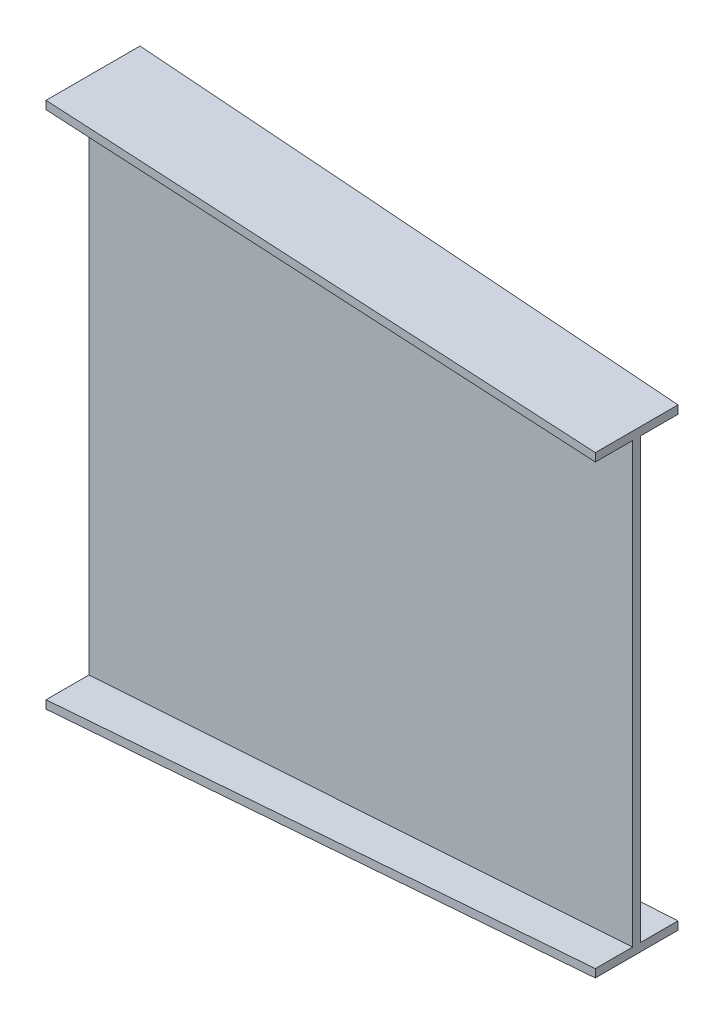
ISO-10303-21;
HEADER;
FILE_DESCRIPTION(('STEP AP214'),'2;1');
FILE_NAME('part.step','',(''),(''),'','','');
FILE_SCHEMA(('AUTOMOTIVE_DESIGN { 1 0 10303 214 1 1 1 1 }'));
ENDSEC;
DATA;
#1=APPLICATION_CONTEXT('core data for automotive mechanical design processes');
#2=APPLICATION_PROTOCOL_DEFINITION('international standard','automotive_design',2000,#1);
#3=PRODUCT_CONTEXT('',#1,'mechanical');
#4=PRODUCT('Part','Part','',(#3));
#5=PRODUCT_RELATED_PRODUCT_CATEGORY('part','',(#4));
#6=PRODUCT_DEFINITION_FORMATION('','',#4);
#7=PRODUCT_DEFINITION_CONTEXT('part definition',#1,'design');
#8=PRODUCT_DEFINITION('design','',#6,#7);
#9=PRODUCT_DEFINITION_SHAPE('','',#8);
#10=(LENGTH_UNIT() NAMED_UNIT(*) SI_UNIT(.MILLI.,.METRE.));
#11=(NAMED_UNIT(*) PLANE_ANGLE_UNIT() SI_UNIT($,.RADIAN.));
#12=(NAMED_UNIT(*) SI_UNIT($,.STERADIAN.) SOLID_ANGLE_UNIT());
#13=UNCERTAINTY_MEASURE_WITH_UNIT(LENGTH_MEASURE(1.E-05),#10,'distance_accuracy_value','');
#14=(GEOMETRIC_REPRESENTATION_CONTEXT(3) GLOBAL_UNCERTAINTY_ASSIGNED_CONTEXT((#13)) GLOBAL_UNIT_ASSIGNED_CONTEXT((#10,
#11,#12)) REPRESENTATION_CONTEXT('',''));
#15=CARTESIAN_POINT('',(0.,0.,0.));
#16=DIRECTION('',(0.,0.,1.));
#17=DIRECTION('',(1.,0.,0.));
#18=AXIS2_PLACEMENT_3D('',#15,#16,#17);
#19=CARTESIAN_POINT('',(1000.,0.,0.));
#20=DIRECTION('',(-1.,0.,0.));
#21=DIRECTION('',(0.,0.,1.));
#22=AXIS2_PLACEMENT_3D('',#19,#20,#21);
#23=PLANE('',#22);
#24=DIRECTION('',(0.,-1.,0.));
#25=VECTOR('',#24,1.);
#26=CARTESIAN_POINT('',(1000.,418.5,-68.4999999999994));
#27=LINE('',#26,#25);
#28=CARTESIAN_POINT('',(1000.,418.5,-68.4999999999994));
#29=VERTEX_POINT('',#28);
#30=CARTESIAN_POINT('',(1000.,403.5,-68.4999999999994));
#31=VERTEX_POINT('',#30);
#32=EDGE_CURVE('E375',#29,#31,#27,.T.);
#33=ORIENTED_EDGE('',*,*,#32,.F.);
#34=DIRECTION('',(0.,0.,-1.));
#35=VECTOR('',#34,1.);
#36=CARTESIAN_POINT('',(1000.,418.5,-68.4999999999994));
#37=LINE('',#36,#35);
#38=CARTESIAN_POINT('',(1000.,418.5,83.5000000000006));
#39=VERTEX_POINT('',#38);
#40=EDGE_CURVE('E12',#39,#29,#37,.T.);
#41=ORIENTED_EDGE('',*,*,#40,.F.);
#42=DIRECTION('',(0.,1.,0.));
#43=VECTOR('',#42,1.);
#44=CARTESIAN_POINT('',(1000.,418.5,83.5000000000006));
#45=LINE('',#44,#43);
#46=CARTESIAN_POINT('',(1000.,403.5,83.5000000000006));
#47=VERTEX_POINT('',#46);
#48=EDGE_CURVE('E69',#47,#39,#45,.T.);
#49=ORIENTED_EDGE('',*,*,#48,.F.);
#50=DIRECTION('',(0.,0.,1.));
#51=VECTOR('',#50,1.);
#52=CARTESIAN_POINT('',(1000.,403.5,15.0000000000006));
#53=LINE('',#52,#51);
#54=CARTESIAN_POINT('',(1000.,403.5,15.0000000000006));
#55=VERTEX_POINT('',#54);
#56=EDGE_CURVE('E650',#55,#47,#53,.T.);
#57=ORIENTED_EDGE('',*,*,#56,.F.);
#58=DIRECTION('',(0.,1.,0.));
#59=VECTOR('',#58,1.);
#60=CARTESIAN_POINT('',(1000.,403.5,15.0000000000006));
#61=LINE('',#60,#59);
#62=CARTESIAN_POINT('',(1000.,-403.5,15.0000000000003));
#63=VERTEX_POINT('',#62);
#64=EDGE_CURVE('E412',#63,#55,#61,.T.);
#65=ORIENTED_EDGE('',*,*,#64,.F.);
#66=DIRECTION('',(0.,0.,-1.));
#67=VECTOR('',#66,1.);
#68=CARTESIAN_POINT('',(1000.,-403.5,15.0000000000003));
#69=LINE('',#68,#67);
#70=CARTESIAN_POINT('',(1000.,-403.5,83.5000000000006));
#71=VERTEX_POINT('',#70);
#72=EDGE_CURVE('E426',#71,#63,#69,.T.);
#73=ORIENTED_EDGE('',*,*,#72,.F.);
#74=DIRECTION('',(0.,1.,0.));
#75=VECTOR('',#74,1.);
#76=CARTESIAN_POINT('',(1000.,-403.5,83.5000000000006));
#77=LINE('',#76,#75);
#78=CARTESIAN_POINT('',(1000.,-418.5,83.5000000000006));
#79=VERTEX_POINT('',#78);
#80=EDGE_CURVE('E440',#79,#71,#77,.T.);
#81=ORIENTED_EDGE('',*,*,#80,.F.);
#82=DIRECTION('',(0.,0.,1.));
#83=VECTOR('',#82,1.);
#84=CARTESIAN_POINT('',(1000.,-418.5,-68.4999999999994));
#85=LINE('',#84,#83);
#86=CARTESIAN_POINT('',(1000.,-418.5,-68.4999999999994));
#87=VERTEX_POINT('',#86);
#88=EDGE_CURVE('E621',#87,#79,#85,.T.);
#89=ORIENTED_EDGE('',*,*,#88,.F.);
#90=DIRECTION('',(0.,-1.,0.));
#91=VECTOR('',#90,1.);
#92=CARTESIAN_POINT('',(1000.,-403.5,-68.4999999999994));
#93=LINE('',#92,#91);
#94=CARTESIAN_POINT('',(1000.,-403.5,-68.4999999999994));
#95=VERTEX_POINT('',#94);
#96=EDGE_CURVE('E613',#95,#87,#93,.T.);
#97=ORIENTED_EDGE('',*,*,#96,.F.);
#98=DIRECTION('',(0.,0.,-1.));
#99=VECTOR('',#98,1.);
#100=CARTESIAN_POINT('',(1000.,-403.5,-68.4999999999994));
#101=LINE('',#100,#99);
#102=CARTESIAN_POINT('',(1000.,-403.5,6.66133814775094E-13));
#103=VERTEX_POINT('',#102);
#104=EDGE_CURVE('E528',#103,#95,#101,.T.);
#105=ORIENTED_EDGE('',*,*,#104,.F.);
#106=DIRECTION('',(0.,-1.,0.));
#107=VECTOR('',#106,1.);
#108=CARTESIAN_POINT('',(1000.,403.5,6.66133814775094E-13));
#109=LINE('',#108,#107);
#110=CARTESIAN_POINT('',(1000.,403.5,6.66133814775094E-13));
#111=VERTEX_POINT('',#110);
#112=EDGE_CURVE('E83',#111,#103,#109,.T.);
#113=ORIENTED_EDGE('',*,*,#112,.F.);
#114=DIRECTION('',(0.,0.,1.));
#115=VECTOR('',#114,1.);
#116=CARTESIAN_POINT('',(1000.,403.5,-68.4999999999994));
#117=LINE('',#116,#115);
#118=EDGE_CURVE('E77',#31,#111,#117,.T.);
#119=ORIENTED_EDGE('',*,*,#118,.F.);
#120=EDGE_LOOP('',(#33,#41,#49,#57,#65,#73,#81,#89,#97,#105,#113,#119));
#121=FACE_BOUND('',#120,.T.);
#122=ADVANCED_FACE('F59',(#121),#23,.F.);
#123=CARTESIAN_POINT('',(0.,0.,0.));
#124=DIRECTION('',(1.,0.,0.));
#125=DIRECTION('',(0.,0.,-1.));
#126=AXIS2_PLACEMENT_3D('',#123,#124,#125);
#127=PLANE('',#126);
#128=DIRECTION('',(0.,-1.,0.));
#129=VECTOR('',#128,1.);
#130=CARTESIAN_POINT('',(0.,485.,94.0000000000004));
#131=LINE('',#130,#129);
#132=CARTESIAN_POINT('',(0.,485.,94.0000000000004));
#133=VERTEX_POINT('',#132);
#134=CARTESIAN_POINT('',(0.,470.,94.0000000000004));
#135=VERTEX_POINT('',#134);
#136=EDGE_CURVE('E158',#133,#135,#131,.T.);
#137=ORIENTED_EDGE('',*,*,#136,.F.);
#138=DIRECTION('',(0.,0.,1.));
#139=VECTOR('',#138,1.);
#140=CARTESIAN_POINT('',(0.,485.,94.0000000000004));
#141=LINE('',#140,#139);
#142=CARTESIAN_POINT('',(0.,485.,-78.9999999999995));
#143=VERTEX_POINT('',#142);
#144=EDGE_CURVE('E167',#143,#133,#141,.T.);
#145=ORIENTED_EDGE('',*,*,#144,.F.);
#146=DIRECTION('',(0.,1.,0.));
#147=VECTOR('',#146,1.);
#148=CARTESIAN_POINT('',(0.,485.,-78.9999999999995));
#149=LINE('',#148,#147);
#150=CARTESIAN_POINT('',(0.,470.,-78.9999999999995));
#151=VERTEX_POINT('',#150);
#152=EDGE_CURVE('E174',#151,#143,#149,.T.);
#153=ORIENTED_EDGE('',*,*,#152,.F.);
#154=DIRECTION('',(0.,0.,-1.));
#155=VECTOR('',#154,1.);
#156=CARTESIAN_POINT('',(0.,470.,4.48288267103926E-13));
#157=LINE('',#156,#155);
#158=CARTESIAN_POINT('',(0.,470.,4.48288267103926E-13));
#159=VERTEX_POINT('',#158);
#160=EDGE_CURVE('E298',#159,#151,#157,.T.);
#161=ORIENTED_EDGE('',*,*,#160,.F.);
#162=DIRECTION('',(0.,1.,0.));
#163=VECTOR('',#162,1.);
#164=CARTESIAN_POINT('',(0.,470.,4.48288267103926E-13));
#165=LINE('',#164,#163);
#166=CARTESIAN_POINT('',(0.,-470.,4.48288267103926E-13));
#167=VERTEX_POINT('',#166);
#168=EDGE_CURVE('E294',#167,#159,#165,.T.);
#169=ORIENTED_EDGE('',*,*,#168,.F.);
#170=DIRECTION('',(0.,0.,1.));
#171=VECTOR('',#170,1.);
#172=CARTESIAN_POINT('',(0.,-470.,4.48288267103926E-13));
#173=LINE('',#172,#171);
#174=CARTESIAN_POINT('',(0.,-470.,-78.9999999999998));
#175=VERTEX_POINT('',#174);
#176=EDGE_CURVE('E290',#175,#167,#173,.T.);
#177=ORIENTED_EDGE('',*,*,#176,.F.);
#178=DIRECTION('',(0.,1.,0.));
#179=VECTOR('',#178,1.);
#180=CARTESIAN_POINT('',(0.,-470.,-78.9999999999998));
#181=LINE('',#180,#179);
#182=CARTESIAN_POINT('',(0.,-485.,-78.9999999999998));
#183=VERTEX_POINT('',#182);
#184=EDGE_CURVE('E286',#183,#175,#181,.T.);
#185=ORIENTED_EDGE('',*,*,#184,.F.);
#186=DIRECTION('',(0.,0.,-1.));
#187=VECTOR('',#186,1.);
#188=CARTESIAN_POINT('',(0.,-485.,94.0000000000001));
#189=LINE('',#188,#187);
#190=CARTESIAN_POINT('',(0.,-485.,94.0000000000001));
#191=VERTEX_POINT('',#190);
#192=EDGE_CURVE('E282',#191,#183,#189,.T.);
#193=ORIENTED_EDGE('',*,*,#192,.F.);
#194=DIRECTION('',(0.,-1.,0.));
#195=VECTOR('',#194,1.);
#196=CARTESIAN_POINT('',(0.,-470.,94.0000000000002));
#197=LINE('',#196,#195);
#198=CARTESIAN_POINT('',(0.,-470.,94.0000000000002));
#199=VERTEX_POINT('',#198);
#200=EDGE_CURVE('E278',#199,#191,#197,.T.);
#201=ORIENTED_EDGE('',*,*,#200,.F.);
#202=DIRECTION('',(0.,0.,1.));
#203=VECTOR('',#202,1.);
#204=CARTESIAN_POINT('',(0.,-470.,94.0000000000002));
#205=LINE('',#204,#203);
#206=CARTESIAN_POINT('',(0.,-470.,15.0000000000005));
#207=VERTEX_POINT('',#206);
#208=EDGE_CURVE('E273',#207,#199,#205,.T.);
#209=ORIENTED_EDGE('',*,*,#208,.F.);
#210=DIRECTION('',(0.,-1.,0.));
#211=VECTOR('',#210,1.);
#212=CARTESIAN_POINT('',(0.,470.,15.0000000000005));
#213=LINE('',#212,#211);
#214=CARTESIAN_POINT('',(0.,470.,15.0000000000005));
#215=VERTEX_POINT('',#214);
#216=EDGE_CURVE('E271',#215,#207,#213,.T.);
#217=ORIENTED_EDGE('',*,*,#216,.F.);
#218=DIRECTION('',(0.,0.,-1.));
#219=VECTOR('',#218,1.);
#220=CARTESIAN_POINT('',(0.,470.,94.0000000000004));
#221=LINE('',#220,#219);
#222=EDGE_CURVE('E180',#135,#215,#221,.T.);
#223=ORIENTED_EDGE('',*,*,#222,.F.);
#224=EDGE_LOOP('',(#137,#145,#153,#161,#169,#177,#185,#193,#201,#209,#217,#223));
#225=FACE_BOUND('',#224,.T.);
#226=ADVANCED_FACE('F178',(#225),#127,.F.);
#227=CARTESIAN_POINT('',(0.,0.,15.0000000000006));
#228=DIRECTION('',(0.,0.,1.));
#229=DIRECTION('',(0.,-1.,0.));
#230=AXIS2_PLACEMENT_3D('',#227,#228,#229);
#231=PLANE('',#230);
#232=DIRECTION('',(0.997796181688927,0.0663534460823136,0.));
#233=VECTOR('',#232,1.);
#234=CARTESIAN_POINT('',(0.,-470.,15.0000000000005));
#235=LINE('',#234,#233);
#236=EDGE_CURVE('E173',#207,#63,#235,.T.);
#237=ORIENTED_EDGE('',*,*,#236,.T.);
#238=ORIENTED_EDGE('',*,*,#64,.T.);
#239=DIRECTION('',(0.997796181688927,-0.0663534460823136,0.));
#240=VECTOR('',#239,1.);
#241=CARTESIAN_POINT('',(0.,470.,15.0000000000005));
#242=LINE('',#241,#240);
#243=EDGE_CURVE('E385',#215,#55,#242,.T.);
#244=ORIENTED_EDGE('',*,*,#243,.F.);
#245=ORIENTED_EDGE('',*,*,#216,.T.);
#246=EDGE_LOOP('',(#237,#238,#244,#245));
#247=FACE_BOUND('',#246,.T.);
#248=ADVANCED_FACE('F201',(#247),#231,.T.);
#249=CARTESIAN_POINT('',(31.1173911171323,467.930693490711,0.));
#250=DIRECTION('',(-0.0663534460823136,-0.997796181688927,0.));
#251=DIRECTION('',(0.997796181688927,-0.0663534460823136,0.));
#252=AXIS2_PLACEMENT_3D('',#249,#250,#251);
#253=PLANE('',#252);
#254=ORIENTED_EDGE('',*,*,#243,.T.);
#255=ORIENTED_EDGE('',*,*,#56,.T.);
#256=DIRECTION('',(0.997741424850504,-0.0663498047525585,-0.0104762849609302));
#257=VECTOR('',#256,1.);
#258=CARTESIAN_POINT('',(0.,470.,94.0000000000004));
#259=LINE('',#258,#257);
#260=EDGE_CURVE('E163',#135,#47,#259,.T.);
#261=ORIENTED_EDGE('',*,*,#260,.F.);
#262=ORIENTED_EDGE('',*,*,#222,.T.);
#263=EDGE_LOOP('',(#254,#255,#261,#262));
#264=FACE_BOUND('',#263,.T.);
#265=ADVANCED_FACE('F387',(#264),#253,.T.);
#266=CARTESIAN_POINT('',(31.1173911171323,-467.930693490711,0.));
#267=DIRECTION('',(-0.0663534460823136,0.997796181688927,0.));
#268=DIRECTION('',(-0.997796181688927,-0.0663534460823136,0.));
#269=AXIS2_PLACEMENT_3D('',#266,#267,#268);
#270=PLANE('',#269);
#271=DIRECTION('',(0.997741424850504,0.0663498047525585,-0.0104762849609299));
#272=VECTOR('',#271,1.);
#273=CARTESIAN_POINT('',(0.,-470.,94.0000000000002));
#274=LINE('',#273,#272);
#275=EDGE_CURVE('E473',#199,#71,#274,.T.);
#276=ORIENTED_EDGE('',*,*,#275,.T.);
#277=ORIENTED_EDGE('',*,*,#72,.T.);
#278=ORIENTED_EDGE('',*,*,#236,.F.);
#279=ORIENTED_EDGE('',*,*,#208,.T.);
#280=EDGE_LOOP('',(#276,#277,#278,#279));
#281=FACE_BOUND('',#280,.T.);
#282=ADVANCED_FACE('F396',(#281),#270,.T.);
#283=CARTESIAN_POINT('',(0.986891195245685,0.,93.9896376424501));
#284=DIRECTION('',(0.0104994212353557,0.,0.99994487955773));
#285=DIRECTION('',(0.99994487955773,0.,-0.0104994212353557));
#286=AXIS2_PLACEMENT_3D('',#283,#284,#285);
#287=PLANE('',#286);
#288=DIRECTION('',(0.997741424850504,0.0663498047525585,-0.0104762849609299));
#289=VECTOR('',#288,1.);
#290=CARTESIAN_POINT('',(0.,-485.,94.0000000000001));
#291=LINE('',#290,#289);
#292=EDGE_CURVE('E465',#191,#79,#291,.T.);
#293=ORIENTED_EDGE('',*,*,#292,.T.);
#294=ORIENTED_EDGE('',*,*,#80,.T.);
#295=ORIENTED_EDGE('',*,*,#275,.F.);
#296=ORIENTED_EDGE('',*,*,#200,.T.);
#297=EDGE_LOOP('',(#293,#294,#295,#296));
#298=FACE_BOUND('',#297,.T.);
#299=ADVANCED_FACE('F446',(#298),#287,.T.);
#300=CARTESIAN_POINT('',(32.1104993442747,-482.864651793606,0.));
#301=DIRECTION('',(0.0663534460823135,-0.997796181688927,0.));
#302=DIRECTION('',(0.997796181688927,0.0663534460823135,0.));
#303=AXIS2_PLACEMENT_3D('',#300,#301,#302);
#304=PLANE('',#303);
#305=DIRECTION('',(0.997741424850504,0.0663498047525584,0.0104762849609307));
#306=VECTOR('',#305,1.);
#307=CARTESIAN_POINT('',(0.,-485.,-78.9999999999998));
#308=LINE('',#307,#306);
#309=EDGE_CURVE('E472',#183,#87,#308,.T.);
#310=ORIENTED_EDGE('',*,*,#309,.T.);
#311=ORIENTED_EDGE('',*,*,#88,.T.);
#312=ORIENTED_EDGE('',*,*,#292,.F.);
#313=ORIENTED_EDGE('',*,*,#192,.T.);
#314=EDGE_LOOP('',(#310,#311,#312,#313));
#315=FACE_BOUND('',#314,.T.);
#316=ADVANCED_FACE('F455',(#315),#304,.T.);
#317=CARTESIAN_POINT('',(0.829408557706543,0.,-78.9912912101439));
#318=DIRECTION('',(0.0104994212353566,0.,-0.99994487955773));
#319=DIRECTION('',(-0.99994487955773,0.,-0.0104994212353566));
#320=AXIS2_PLACEMENT_3D('',#317,#318,#319);
#321=PLANE('',#320);
#322=DIRECTION('',(0.997741424850504,0.0663498047525584,0.0104762849609307));
#323=VECTOR('',#322,1.);
#324=CARTESIAN_POINT('',(0.,-470.,-78.9999999999998));
#325=LINE('',#324,#323);
#326=EDGE_CURVE('E490',#175,#95,#325,.T.);
#327=ORIENTED_EDGE('',*,*,#326,.T.);
#328=ORIENTED_EDGE('',*,*,#96,.T.);
#329=ORIENTED_EDGE('',*,*,#309,.F.);
#330=ORIENTED_EDGE('',*,*,#184,.T.);
#331=EDGE_LOOP('',(#327,#328,#329,#330));
#332=FACE_BOUND('',#331,.T.);
#333=ADVANCED_FACE('F501',(#332),#321,.T.);
#334=CARTESIAN_POINT('',(31.1173911171323,-467.930693490711,0.));
#335=DIRECTION('',(-0.0663534460823136,0.997796181688927,0.));
#336=DIRECTION('',(-0.997796181688927,-0.0663534460823136,0.));
#337=AXIS2_PLACEMENT_3D('',#334,#335,#336);
#338=PLANE('',#337);
#339=DIRECTION('',(0.997796181688927,0.0663534460823136,0.));
#340=VECTOR('',#339,1.);
#341=CARTESIAN_POINT('',(0.,-470.,4.48288267103926E-13));
#342=LINE('',#341,#340);
#343=EDGE_CURVE('E567',#167,#103,#342,.T.);
#344=ORIENTED_EDGE('',*,*,#343,.T.);
#345=ORIENTED_EDGE('',*,*,#104,.T.);
#346=ORIENTED_EDGE('',*,*,#326,.F.);
#347=ORIENTED_EDGE('',*,*,#176,.T.);
#348=EDGE_LOOP('',(#344,#345,#346,#347));
#349=FACE_BOUND('',#348,.T.);
#350=ADVANCED_FACE('F510',(#349),#338,.T.);
#351=CARTESIAN_POINT('',(0.,0.,4.48288267103926E-13));
#352=DIRECTION('',(0.,0.,-1.));
#353=DIRECTION('',(-1.,0.,0.));
#354=AXIS2_PLACEMENT_3D('',#351,#352,#353);
#355=PLANE('',#354);
#356=DIRECTION('',(0.997796181688927,-0.0663534460823136,0.));
#357=VECTOR('',#356,1.);
#358=CARTESIAN_POINT('',(0.,470.,4.48288267103926E-13));
#359=LINE('',#358,#357);
#360=EDGE_CURVE('E559',#159,#111,#359,.T.);
#361=ORIENTED_EDGE('',*,*,#360,.T.);
#362=ORIENTED_EDGE('',*,*,#112,.T.);
#363=ORIENTED_EDGE('',*,*,#343,.F.);
#364=ORIENTED_EDGE('',*,*,#168,.T.);
#365=EDGE_LOOP('',(#361,#362,#363,#364));
#366=FACE_BOUND('',#365,.T.);
#367=ADVANCED_FACE('F544',(#366),#355,.T.);
#368=CARTESIAN_POINT('',(31.1173911171323,467.930693490711,0.));
#369=DIRECTION('',(-0.0663534460823136,-0.997796181688927,0.));
#370=DIRECTION('',(0.997796181688927,-0.0663534460823136,0.));
#371=AXIS2_PLACEMENT_3D('',#368,#369,#370);
#372=PLANE('',#371);
#373=DIRECTION('',(0.997741424850504,-0.0663498047525585,0.0104762849609304));
#374=VECTOR('',#373,1.);
#375=CARTESIAN_POINT('',(0.,470.,-78.9999999999995));
#376=LINE('',#375,#374);
#377=EDGE_CURVE('E566',#151,#31,#376,.T.);
#378=ORIENTED_EDGE('',*,*,#377,.T.);
#379=ORIENTED_EDGE('',*,*,#118,.T.);
#380=ORIENTED_EDGE('',*,*,#360,.F.);
#381=ORIENTED_EDGE('',*,*,#160,.T.);
#382=EDGE_LOOP('',(#378,#379,#380,#381));
#383=FACE_BOUND('',#382,.T.);
#384=ADVANCED_FACE('F325',(#383),#372,.T.);
#385=CARTESIAN_POINT('',(0.829408557706515,0.,-78.9912912101436));
#386=DIRECTION('',(0.0104994212353563,0.,-0.99994487955773));
#387=DIRECTION('',(-0.99994487955773,0.,-0.0104994212353563));
#388=AXIS2_PLACEMENT_3D('',#385,#386,#387);
#389=PLANE('',#388);
#390=DIRECTION('',(0.997741424850504,-0.0663498047525585,0.0104762849609304));
#391=VECTOR('',#390,1.);
#392=CARTESIAN_POINT('',(0.,485.,-78.9999999999995));
#393=LINE('',#392,#391);
#394=EDGE_CURVE('E164',#143,#29,#393,.T.);
#395=ORIENTED_EDGE('',*,*,#394,.T.);
#396=ORIENTED_EDGE('',*,*,#32,.T.);
#397=ORIENTED_EDGE('',*,*,#377,.F.);
#398=ORIENTED_EDGE('',*,*,#152,.T.);
#399=EDGE_LOOP('',(#395,#396,#397,#398));
#400=FACE_BOUND('',#399,.T.);
#401=ADVANCED_FACE('F315',(#400),#389,.T.);
#402=CARTESIAN_POINT('',(32.1104993442748,482.864651793606,0.));
#403=DIRECTION('',(0.0663534460823136,0.997796181688927,0.));
#404=DIRECTION('',(-0.997796181688927,0.0663534460823136,0.));
#405=AXIS2_PLACEMENT_3D('',#402,#403,#404);
#406=PLANE('',#405);
#407=DIRECTION('',(0.997741424850504,-0.0663498047525585,-0.0104762849609302));
#408=VECTOR('',#407,1.);
#409=CARTESIAN_POINT('',(0.,485.,94.0000000000004));
#410=LINE('',#409,#408);
#411=EDGE_CURVE('E153',#133,#39,#410,.T.);
#412=ORIENTED_EDGE('',*,*,#411,.T.);
#413=ORIENTED_EDGE('',*,*,#40,.T.);
#414=ORIENTED_EDGE('',*,*,#394,.F.);
#415=ORIENTED_EDGE('',*,*,#144,.T.);
#416=EDGE_LOOP('',(#412,#413,#414,#415));
#417=FACE_BOUND('',#416,.T.);
#418=ADVANCED_FACE('F169',(#417),#406,.T.);
#419=CARTESIAN_POINT('',(0.986891195245717,0.,93.9896376424504));
#420=DIRECTION('',(0.010499421235356,0.,0.99994487955773));
#421=DIRECTION('',(0.99994487955773,0.,-0.010499421235356));
#422=AXIS2_PLACEMENT_3D('',#419,#420,#421);
#423=PLANE('',#422);
#424=ORIENTED_EDGE('',*,*,#260,.T.);
#425=ORIENTED_EDGE('',*,*,#48,.T.);
#426=ORIENTED_EDGE('',*,*,#411,.F.);
#427=ORIENTED_EDGE('',*,*,#136,.T.);
#428=EDGE_LOOP('',(#424,#425,#426,#427));
#429=FACE_BOUND('',#428,.T.);
#430=ADVANCED_FACE('F156',(#429),#423,.T.);
#431=CLOSED_SHELL('',(#122,#226,#248,#265,#282,#299,#316,#333,#350,#367,#384,#401,#418,#430));
#432=MANIFOLD_SOLID_BREP('B2',#431);
#433=ADVANCED_BREP_SHAPE_REPRESENTATION('',(#18,#432),#14);
#434=SHAPE_DEFINITION_REPRESENTATION(#9,#433);
ENDSEC;
END-ISO-10303-21;
